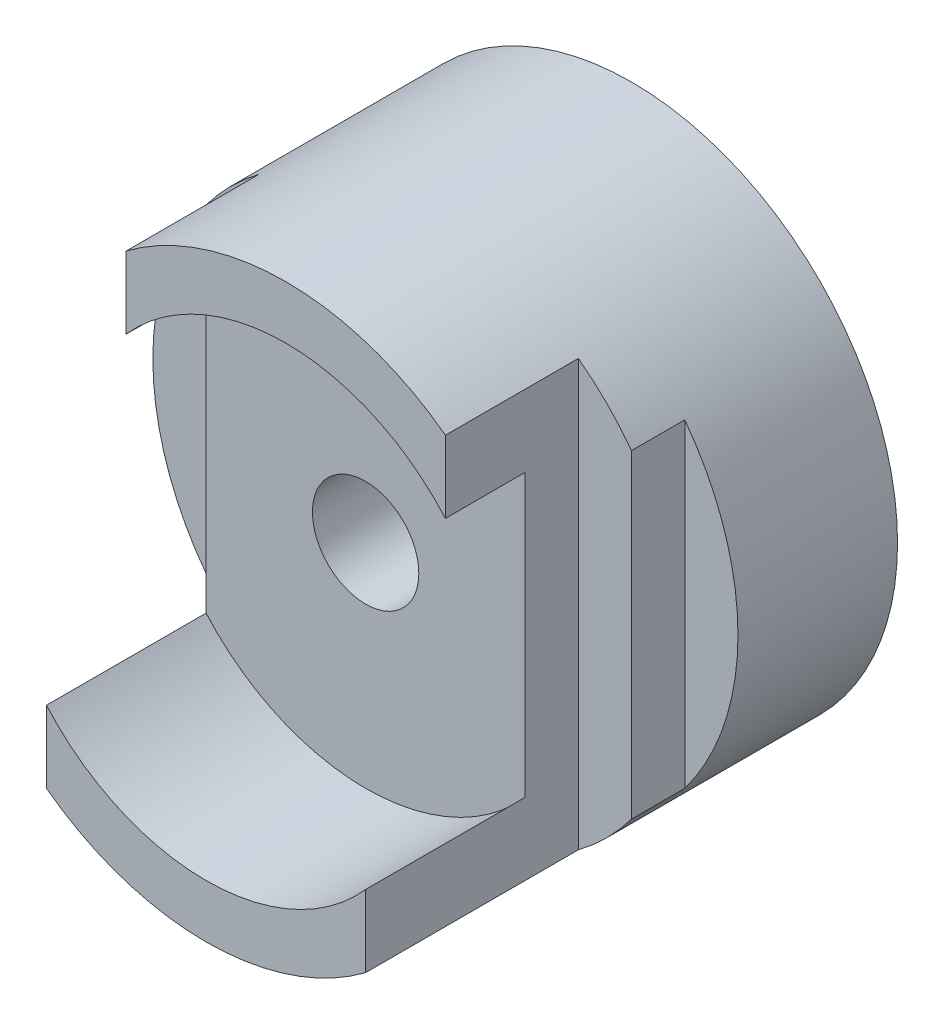
ISO-10303-21;
HEADER;
FILE_DESCRIPTION(('STEP AP214'),'2;1');
FILE_NAME('part.step','',(''),(''),'','','');
FILE_SCHEMA(('AUTOMOTIVE_DESIGN { 1 0 10303 214 1 1 1 1 }'));
ENDSEC;
DATA;
#1=APPLICATION_CONTEXT('core data for automotive mechanical design processes');
#2=APPLICATION_PROTOCOL_DEFINITION('international standard','automotive_design',2000,#1);
#3=PRODUCT_CONTEXT('',#1,'mechanical');
#4=PRODUCT('Part','Part','',(#3));
#5=PRODUCT_RELATED_PRODUCT_CATEGORY('part','',(#4));
#6=PRODUCT_DEFINITION_FORMATION('','',#4);
#7=PRODUCT_DEFINITION_CONTEXT('part definition',#1,'design');
#8=PRODUCT_DEFINITION('design','',#6,#7);
#9=PRODUCT_DEFINITION_SHAPE('','',#8);
#10=(LENGTH_UNIT() NAMED_UNIT(*) SI_UNIT(.MILLI.,.METRE.));
#11=(NAMED_UNIT(*) PLANE_ANGLE_UNIT() SI_UNIT($,.RADIAN.));
#12=(NAMED_UNIT(*) SI_UNIT($,.STERADIAN.) SOLID_ANGLE_UNIT());
#13=UNCERTAINTY_MEASURE_WITH_UNIT(LENGTH_MEASURE(1.E-05),#10,'distance_accuracy_value','');
#14=(GEOMETRIC_REPRESENTATION_CONTEXT(3) GLOBAL_UNCERTAINTY_ASSIGNED_CONTEXT((#13)) GLOBAL_UNIT_ASSIGNED_CONTEXT((#10,
#11,#12)) REPRESENTATION_CONTEXT('',''));
#15=CARTESIAN_POINT('',(0.,0.,0.));
#16=DIRECTION('',(0.,0.,1.));
#17=DIRECTION('',(1.,0.,0.));
#18=AXIS2_PLACEMENT_3D('',#15,#16,#17);
#19=CARTESIAN_POINT('',(0.,0.,8.));
#20=DIRECTION('',(0.,0.,-1.));
#21=DIRECTION('',(-1.,0.,0.));
#22=AXIS2_PLACEMENT_3D('',#19,#20,#21);
#23=CYLINDRICAL_SURFACE('',#22,1.);
#24=CARTESIAN_POINT('',(0.,0.,0.));
#25=DIRECTION('',(0.,0.,1.));
#26=DIRECTION('',(1.,0.,0.));
#27=AXIS2_PLACEMENT_3D('',#24,#25,#26);
#28=CIRCLE('',#27,1.);
#29=CARTESIAN_POINT('',(1.,0.,0.));
#30=VERTEX_POINT('',#29);
#31=EDGE_CURVE('E171',#30,#30,#28,.T.);
#32=ORIENTED_EDGE('',*,*,#31,.F.);
#33=EDGE_LOOP('',(#32));
#34=FACE_BOUND('',#33,.T.);
#35=CARTESIAN_POINT('',(0.,0.,5.));
#36=DIRECTION('',(0.,0.,1.));
#37=DIRECTION('',(1.,0.,0.));
#38=AXIS2_PLACEMENT_3D('',#35,#36,#37);
#39=CIRCLE('',#38,1.);
#40=CARTESIAN_POINT('',(1.,0.,5.));
#41=VERTEX_POINT('',#40);
#42=EDGE_CURVE('E213',#41,#41,#39,.T.);
#43=ORIENTED_EDGE('',*,*,#42,.T.);
#44=EDGE_LOOP('',(#43));
#45=FACE_BOUND('',#44,.T.);
#46=ADVANCED_FACE('F33',(#34,#45),#23,.F.);
#47=CARTESIAN_POINT('',(0.,0.,8.));
#48=DIRECTION('',(0.,0.,-1.));
#49=DIRECTION('',(-1.,0.,0.));
#50=AXIS2_PLACEMENT_3D('',#47,#48,#49);
#51=CYLINDRICAL_SURFACE('',#50,5.);
#52=CARTESIAN_POINT('',(0.,0.,0.999999999999999));
#53=DIRECTION('',(0.,0.,1.));
#54=DIRECTION('',(1.,0.,0.));
#55=AXIS2_PLACEMENT_3D('',#52,#53,#54);
#56=CIRCLE('',#55,5.);
#57=CARTESIAN_POINT('',(-4.,3.,1.));
#58=VERTEX_POINT('',#57);
#59=CARTESIAN_POINT('',(-4.,-3.,1.));
#60=VERTEX_POINT('',#59);
#61=EDGE_CURVE('E149',#58,#60,#56,.T.);
#62=ORIENTED_EDGE('',*,*,#61,.T.);
#63=DIRECTION('',(0.,0.,-1.));
#64=VECTOR('',#63,1.);
#65=CARTESIAN_POINT('',(-3.99999999999999,-3.00000000000001,8.));
#66=LINE('',#65,#64);
#67=CARTESIAN_POINT('',(-4.,-3.00000000000001,0.));
#68=VERTEX_POINT('',#67);
#69=EDGE_CURVE('E141',#60,#68,#66,.T.);
#70=ORIENTED_EDGE('',*,*,#69,.T.);
#71=CARTESIAN_POINT('',(0.,0.,0.));
#72=DIRECTION('',(0.,0.,1.));
#73=DIRECTION('',(1.,0.,0.));
#74=AXIS2_PLACEMENT_3D('',#71,#72,#73);
#75=CIRCLE('',#74,5.);
#76=CARTESIAN_POINT('',(-4.,3.00000000000001,0.));
#77=VERTEX_POINT('',#76);
#78=EDGE_CURVE('E168',#68,#77,#75,.T.);
#79=ORIENTED_EDGE('',*,*,#78,.T.);
#80=DIRECTION('',(0.,0.,-1.));
#81=VECTOR('',#80,1.);
#82=CARTESIAN_POINT('',(-3.99999999999999,3.00000000000001,8.));
#83=LINE('',#82,#81);
#84=EDGE_CURVE('E146',#77,#58,#83,.F.);
#85=ORIENTED_EDGE('',*,*,#84,.T.);
#86=EDGE_LOOP('',(#62,#70,#79,#85));
#87=FACE_BOUND('',#86,.T.);
#88=DIRECTION('',(0.,0.,-1.));
#89=VECTOR('',#88,1.);
#90=CARTESIAN_POINT('',(-3.,4.,8.));
#91=LINE('',#90,#89);
#92=CARTESIAN_POINT('',(-3.,4.,6.5));
#93=VERTEX_POINT('',#92);
#94=CARTESIAN_POINT('',(-3.,4.,4.));
#95=VERTEX_POINT('',#94);
#96=EDGE_CURVE('E184',#93,#95,#91,.T.);
#97=ORIENTED_EDGE('',*,*,#96,.F.);
#98=CARTESIAN_POINT('',(0.,0.,6.5));
#99=DIRECTION('',(0.,0.,-1.));
#100=DIRECTION('',(-1.,0.,0.));
#101=AXIS2_PLACEMENT_3D('',#98,#99,#100);
#102=CIRCLE('',#101,5.);
#103=CARTESIAN_POINT('',(3.,4.,6.5));
#104=VERTEX_POINT('',#103);
#105=EDGE_CURVE('E220',#93,#104,#102,.T.);
#106=ORIENTED_EDGE('',*,*,#105,.T.);
#107=DIRECTION('',(0.,0.,1.));
#108=VECTOR('',#107,1.);
#109=CARTESIAN_POINT('',(3.,4.,8.));
#110=LINE('',#109,#108);
#111=CARTESIAN_POINT('',(3.,4.,4.));
#112=VERTEX_POINT('',#111);
#113=EDGE_CURVE('E132',#112,#104,#110,.T.);
#114=ORIENTED_EDGE('',*,*,#113,.F.);
#115=CARTESIAN_POINT('',(0.,0.,4.));
#116=DIRECTION('',(0.,0.,-1.));
#117=DIRECTION('',(-1.,0.,0.));
#118=AXIS2_PLACEMENT_3D('',#115,#116,#117);
#119=CIRCLE('',#118,5.);
#120=CARTESIAN_POINT('',(4.,3.,4.));
#121=VERTEX_POINT('',#120);
#122=EDGE_CURVE('E161',#112,#121,#119,.T.);
#123=ORIENTED_EDGE('',*,*,#122,.T.);
#124=DIRECTION('',(0.,0.,-1.));
#125=VECTOR('',#124,1.);
#126=CARTESIAN_POINT('',(4.,3.,8.));
#127=LINE('',#126,#125);
#128=CARTESIAN_POINT('',(4.,3.,3.));
#129=VERTEX_POINT('',#128);
#130=EDGE_CURVE('E158',#121,#129,#127,.T.);
#131=ORIENTED_EDGE('',*,*,#130,.T.);
#132=CARTESIAN_POINT('',(0.,0.,3.));
#133=DIRECTION('',(0.,0.,-1.));
#134=DIRECTION('',(-1.,0.,0.));
#135=AXIS2_PLACEMENT_3D('',#132,#133,#134);
#136=CIRCLE('',#135,5.);
#137=CARTESIAN_POINT('',(4.,-3.,3.));
#138=VERTEX_POINT('',#137);
#139=EDGE_CURVE('E156',#129,#138,#136,.T.);
#140=ORIENTED_EDGE('',*,*,#139,.T.);
#141=DIRECTION('',(0.,0.,-1.));
#142=VECTOR('',#141,1.);
#143=CARTESIAN_POINT('',(4.,-3.,8.));
#144=LINE('',#143,#142);
#145=CARTESIAN_POINT('',(4.,-3.,4.));
#146=VERTEX_POINT('',#145);
#147=EDGE_CURVE('E152',#138,#146,#144,.F.);
#148=ORIENTED_EDGE('',*,*,#147,.T.);
#149=CARTESIAN_POINT('',(3.,-4.,4.));
#150=VERTEX_POINT('',#149);
#151=EDGE_CURVE('E155',#146,#150,#119,.T.);
#152=ORIENTED_EDGE('',*,*,#151,.T.);
#153=DIRECTION('',(0.,0.,1.));
#154=VECTOR('',#153,1.);
#155=CARTESIAN_POINT('',(3.,-4.,8.));
#156=LINE('',#155,#154);
#157=CARTESIAN_POINT('',(3.,-4.,8.));
#158=VERTEX_POINT('',#157);
#159=EDGE_CURVE('E192',#150,#158,#156,.T.);
#160=ORIENTED_EDGE('',*,*,#159,.T.);
#161=CARTESIAN_POINT('',(0.,0.,8.));
#162=DIRECTION('',(0.,0.,1.));
#163=DIRECTION('',(1.,0.,0.));
#164=AXIS2_PLACEMENT_3D('',#161,#162,#163);
#165=CIRCLE('',#164,5.);
#166=CARTESIAN_POINT('',(-3.,-4.,8.));
#167=VERTEX_POINT('',#166);
#168=EDGE_CURVE('E167',#167,#158,#165,.T.);
#169=ORIENTED_EDGE('',*,*,#168,.F.);
#170=DIRECTION('',(0.,0.,-1.));
#171=VECTOR('',#170,1.);
#172=CARTESIAN_POINT('',(-3.,-4.,8.));
#173=LINE('',#172,#171);
#174=CARTESIAN_POINT('',(-3.,-4.,4.));
#175=VERTEX_POINT('',#174);
#176=EDGE_CURVE('E181',#167,#175,#173,.T.);
#177=ORIENTED_EDGE('',*,*,#176,.T.);
#178=CARTESIAN_POINT('',(0.,0.,4.));
#179=DIRECTION('',(0.,0.,-1.));
#180=DIRECTION('',(-1.,0.,0.));
#181=AXIS2_PLACEMENT_3D('',#178,#179,#180);
#182=CIRCLE('',#181,5.);
#183=EDGE_CURVE('E164',#175,#95,#182,.T.);
#184=ORIENTED_EDGE('',*,*,#183,.T.);
#185=EDGE_LOOP('',(#97,#106,#114,#123,#131,#140,#148,#152,#160,#169,#177,#184));
#186=FACE_BOUND('',#185,.T.);
#187=ADVANCED_FACE('F35',(#87,#186),#51,.T.);
#188=CARTESIAN_POINT('',(0.,0.,8.));
#189=DIRECTION('',(0.,0.,1.));
#190=DIRECTION('',(1.,0.,0.));
#191=AXIS2_PLACEMENT_3D('',#188,#189,#190);
#192=PLANE('',#191);
#193=CARTESIAN_POINT('',(0.,0.,8.));
#194=DIRECTION('',(0.,0.,1.));
#195=DIRECTION('',(1.,0.,0.));
#196=AXIS2_PLACEMENT_3D('',#193,#194,#195);
#197=CIRCLE('',#196,4.);
#198=CARTESIAN_POINT('',(-3.,-2.64575131106459,8.));
#199=VERTEX_POINT('',#198);
#200=CARTESIAN_POINT('',(3.,-2.64575131106459,8.));
#201=VERTEX_POINT('',#200);
#202=EDGE_CURVE('E218',#199,#201,#197,.T.);
#203=ORIENTED_EDGE('',*,*,#202,.F.);
#204=DIRECTION('',(0.,1.,0.));
#205=VECTOR('',#204,1.);
#206=CARTESIAN_POINT('',(-3.,-4.,8.));
#207=LINE('',#206,#205);
#208=EDGE_CURVE('E177',#167,#199,#207,.T.);
#209=ORIENTED_EDGE('',*,*,#208,.F.);
#210=ORIENTED_EDGE('',*,*,#168,.T.);
#211=DIRECTION('',(0.,1.,0.));
#212=VECTOR('',#211,1.);
#213=CARTESIAN_POINT('',(3.,-4.,8.));
#214=LINE('',#213,#212);
#215=EDGE_CURVE('E191',#158,#201,#214,.T.);
#216=ORIENTED_EDGE('',*,*,#215,.T.);
#217=EDGE_LOOP('',(#203,#209,#210,#216));
#218=FACE_BOUND('',#217,.T.);
#219=ADVANCED_FACE('F235',(#218),#192,.T.);
#220=CARTESIAN_POINT('',(0.,0.,0.));
#221=DIRECTION('',(0.,0.,1.));
#222=DIRECTION('',(1.,0.,0.));
#223=AXIS2_PLACEMENT_3D('',#220,#221,#222);
#224=PLANE('',#223);
#225=ORIENTED_EDGE('',*,*,#78,.F.);
#226=DIRECTION('',(0.,1.,0.));
#227=VECTOR('',#226,1.);
#228=CARTESIAN_POINT('',(-4.,-4.,0.));
#229=LINE('',#228,#227);
#230=EDGE_CURVE('E176',#68,#77,#229,.T.);
#231=ORIENTED_EDGE('',*,*,#230,.T.);
#232=EDGE_LOOP('',(#225,#231));
#233=FACE_BOUND('',#232,.T.);
#234=ORIENTED_EDGE('',*,*,#31,.T.);
#235=EDGE_LOOP('',(#234));
#236=FACE_BOUND('',#235,.T.);
#237=ADVANCED_FACE('F265',(#233,#236),#224,.F.);
#238=CARTESIAN_POINT('',(-5.,-4.,4.));
#239=DIRECTION('',(0.,0.,-1.));
#240=DIRECTION('',(-1.,0.,0.));
#241=AXIS2_PLACEMENT_3D('',#238,#239,#240);
#242=PLANE('',#241);
#243=ORIENTED_EDGE('',*,*,#183,.F.);
#244=DIRECTION('',(0.,1.,0.));
#245=VECTOR('',#244,1.);
#246=CARTESIAN_POINT('',(-3.,-4.,4.));
#247=LINE('',#246,#245);
#248=EDGE_CURVE('E180',#175,#95,#247,.T.);
#249=ORIENTED_EDGE('',*,*,#248,.T.);
#250=EDGE_LOOP('',(#243,#249));
#251=FACE_BOUND('',#250,.T.);
#252=ADVANCED_FACE('F231',(#251),#242,.F.);
#253=CARTESIAN_POINT('',(-3.,-4.,8.));
#254=DIRECTION('',(1.,0.,0.));
#255=DIRECTION('',(0.,0.,-1.));
#256=AXIS2_PLACEMENT_3D('',#253,#254,#255);
#257=PLANE('',#256);
#258=DIRECTION('',(0.,0.,1.));
#259=VECTOR('',#258,1.);
#260=CARTESIAN_POINT('',(-3.,2.64575131106459,5.));
#261=LINE('',#260,#259);
#262=CARTESIAN_POINT('',(-3.,2.64575131106459,5.));
#263=VERTEX_POINT('',#262);
#264=CARTESIAN_POINT('',(-3.,2.64575131106459,6.5));
#265=VERTEX_POINT('',#264);
#266=EDGE_CURVE('E186',#263,#265,#261,.T.);
#267=ORIENTED_EDGE('',*,*,#266,.T.);
#268=DIRECTION('',(0.,1.,0.));
#269=VECTOR('',#268,1.);
#270=CARTESIAN_POINT('',(-3.,-4.,6.5));
#271=LINE('',#270,#269);
#272=EDGE_CURVE('E48',#265,#93,#271,.T.);
#273=ORIENTED_EDGE('',*,*,#272,.T.);
#274=ORIENTED_EDGE('',*,*,#96,.T.);
#275=ORIENTED_EDGE('',*,*,#248,.F.);
#276=ORIENTED_EDGE('',*,*,#176,.F.);
#277=ORIENTED_EDGE('',*,*,#208,.T.);
#278=DIRECTION('',(0.,0.,1.));
#279=VECTOR('',#278,1.);
#280=CARTESIAN_POINT('',(-3.,-2.64575131106459,5.));
#281=LINE('',#280,#279);
#282=CARTESIAN_POINT('',(-3.,-2.64575131106459,5.));
#283=VERTEX_POINT('',#282);
#284=EDGE_CURVE('E210',#199,#283,#281,.F.);
#285=ORIENTED_EDGE('',*,*,#284,.T.);
#286=DIRECTION('',(0.,-1.,0.));
#287=VECTOR('',#286,1.);
#288=CARTESIAN_POINT('',(-3.,-4.,5.));
#289=LINE('',#288,#287);
#290=EDGE_CURVE('E216',#263,#283,#289,.T.);
#291=ORIENTED_EDGE('',*,*,#290,.F.);
#292=EDGE_LOOP('',(#267,#273,#274,#275,#276,#277,#285,#291));
#293=FACE_BOUND('',#292,.T.);
#294=ADVANCED_FACE('F225',(#293),#257,.F.);
#295=CARTESIAN_POINT('',(3.,-4.,4.));
#296=DIRECTION('',(0.,0.,-1.));
#297=DIRECTION('',(-1.,0.,0.));
#298=AXIS2_PLACEMENT_3D('',#295,#296,#297);
#299=PLANE('',#298);
#300=DIRECTION('',(0.,1.,0.));
#301=VECTOR('',#300,1.);
#302=CARTESIAN_POINT('',(3.,-4.,4.));
#303=LINE('',#302,#301);
#304=EDGE_CURVE('E189',#150,#112,#303,.T.);
#305=ORIENTED_EDGE('',*,*,#304,.F.);
#306=ORIENTED_EDGE('',*,*,#151,.F.);
#307=DIRECTION('',(0.,1.,0.));
#308=VECTOR('',#307,1.);
#309=CARTESIAN_POINT('',(4.,-4.,4.));
#310=LINE('',#309,#308);
#311=EDGE_CURVE('E198',#146,#121,#310,.T.);
#312=ORIENTED_EDGE('',*,*,#311,.T.);
#313=ORIENTED_EDGE('',*,*,#122,.F.);
#314=EDGE_LOOP('',(#305,#306,#312,#313));
#315=FACE_BOUND('',#314,.T.);
#316=ADVANCED_FACE('F290',(#315),#299,.F.);
#317=CARTESIAN_POINT('',(4.,-4.,4.));
#318=DIRECTION('',(-1.,0.,0.));
#319=DIRECTION('',(0.,0.,1.));
#320=AXIS2_PLACEMENT_3D('',#317,#318,#319);
#321=PLANE('',#320);
#322=ORIENTED_EDGE('',*,*,#311,.F.);
#323=ORIENTED_EDGE('',*,*,#147,.F.);
#324=DIRECTION('',(0.,1.,0.));
#325=VECTOR('',#324,1.);
#326=CARTESIAN_POINT('',(4.,-4.,3.));
#327=LINE('',#326,#325);
#328=EDGE_CURVE('E195',#138,#129,#327,.T.);
#329=ORIENTED_EDGE('',*,*,#328,.T.);
#330=ORIENTED_EDGE('',*,*,#130,.F.);
#331=EDGE_LOOP('',(#322,#323,#329,#330));
#332=FACE_BOUND('',#331,.T.);
#333=ADVANCED_FACE('F286',(#332),#321,.F.);
#334=CARTESIAN_POINT('',(4.,-4.,3.));
#335=DIRECTION('',(0.,0.,-1.));
#336=DIRECTION('',(-1.,0.,0.));
#337=AXIS2_PLACEMENT_3D('',#334,#335,#336);
#338=PLANE('',#337);
#339=ORIENTED_EDGE('',*,*,#328,.F.);
#340=ORIENTED_EDGE('',*,*,#139,.F.);
#341=EDGE_LOOP('',(#339,#340));
#342=FACE_BOUND('',#341,.T.);
#343=ADVANCED_FACE('F289',(#342),#338,.F.);
#344=CARTESIAN_POINT('',(3.,-4.,8.));
#345=DIRECTION('',(-1.,0.,0.));
#346=DIRECTION('',(0.,0.,1.));
#347=AXIS2_PLACEMENT_3D('',#344,#345,#346);
#348=PLANE('',#347);
#349=ORIENTED_EDGE('',*,*,#113,.T.);
#350=DIRECTION('',(0.,-1.,0.));
#351=VECTOR('',#350,1.);
#352=CARTESIAN_POINT('',(3.,-4.,6.5));
#353=LINE('',#352,#351);
#354=CARTESIAN_POINT('',(3.,2.64575131106459,6.5));
#355=VERTEX_POINT('',#354);
#356=EDGE_CURVE('E121',#104,#355,#353,.T.);
#357=ORIENTED_EDGE('',*,*,#356,.T.);
#358=DIRECTION('',(0.,0.,1.));
#359=VECTOR('',#358,1.);
#360=CARTESIAN_POINT('',(3.,2.64575131106459,5.));
#361=LINE('',#360,#359);
#362=CARTESIAN_POINT('',(3.,2.64575131106459,5.));
#363=VERTEX_POINT('',#362);
#364=EDGE_CURVE('E130',#355,#363,#361,.F.);
#365=ORIENTED_EDGE('',*,*,#364,.T.);
#366=DIRECTION('',(0.,1.,0.));
#367=VECTOR('',#366,1.);
#368=CARTESIAN_POINT('',(3.,-4.,5.));
#369=LINE('',#368,#367);
#370=CARTESIAN_POINT('',(3.,-2.64575131106459,5.));
#371=VERTEX_POINT('',#370);
#372=EDGE_CURVE('E138',#371,#363,#369,.T.);
#373=ORIENTED_EDGE('',*,*,#372,.F.);
#374=DIRECTION('',(0.,0.,1.));
#375=VECTOR('',#374,1.);
#376=CARTESIAN_POINT('',(3.,-2.64575131106459,5.));
#377=LINE('',#376,#375);
#378=EDGE_CURVE('E41',#371,#201,#377,.T.);
#379=ORIENTED_EDGE('',*,*,#378,.T.);
#380=ORIENTED_EDGE('',*,*,#215,.F.);
#381=ORIENTED_EDGE('',*,*,#159,.F.);
#382=ORIENTED_EDGE('',*,*,#304,.T.);
#383=EDGE_LOOP('',(#349,#357,#365,#373,#379,#380,#381,#382));
#384=FACE_BOUND('',#383,.T.);
#385=ADVANCED_FACE('F128',(#384),#348,.F.);
#386=CARTESIAN_POINT('',(-4.,-4.,0.));
#387=DIRECTION('',(1.,0.,0.));
#388=DIRECTION('',(0.,0.,-1.));
#389=AXIS2_PLACEMENT_3D('',#386,#387,#388);
#390=PLANE('',#389);
#391=DIRECTION('',(0.,1.,0.));
#392=VECTOR('',#391,1.);
#393=CARTESIAN_POINT('',(-4.,-4.,1.));
#394=LINE('',#393,#392);
#395=EDGE_CURVE('E201',#60,#58,#394,.T.);
#396=ORIENTED_EDGE('',*,*,#395,.T.);
#397=ORIENTED_EDGE('',*,*,#84,.F.);
#398=ORIENTED_EDGE('',*,*,#230,.F.);
#399=ORIENTED_EDGE('',*,*,#69,.F.);
#400=EDGE_LOOP('',(#396,#397,#398,#399));
#401=FACE_BOUND('',#400,.T.);
#402=ADVANCED_FACE('F275',(#401),#390,.F.);
#403=CARTESIAN_POINT('',(-5.,-4.,1.));
#404=DIRECTION('',(0.,0.,1.));
#405=DIRECTION('',(1.,0.,0.));
#406=AXIS2_PLACEMENT_3D('',#403,#404,#405);
#407=PLANE('',#406);
#408=ORIENTED_EDGE('',*,*,#395,.F.);
#409=ORIENTED_EDGE('',*,*,#61,.F.);
#410=EDGE_LOOP('',(#408,#409));
#411=FACE_BOUND('',#410,.T.);
#412=ADVANCED_FACE('F277',(#411),#407,.F.);
#413=CARTESIAN_POINT('',(0.,0.,5.));
#414=DIRECTION('',(0.,0.,1.));
#415=DIRECTION('',(1.,0.,0.));
#416=AXIS2_PLACEMENT_3D('',#413,#414,#415);
#417=CYLINDRICAL_SURFACE('',#416,4.);
#418=ORIENTED_EDGE('',*,*,#364,.F.);
#419=CARTESIAN_POINT('',(0.,0.,6.5));
#420=DIRECTION('',(0.,0.,-1.));
#421=DIRECTION('',(-1.,0.,0.));
#422=AXIS2_PLACEMENT_3D('',#419,#420,#421);
#423=CIRCLE('',#422,4.);
#424=EDGE_CURVE('E11',#355,#265,#423,.F.);
#425=ORIENTED_EDGE('',*,*,#424,.T.);
#426=ORIENTED_EDGE('',*,*,#266,.F.);
#427=CARTESIAN_POINT('',(0.,0.,5.));
#428=DIRECTION('',(0.,0.,1.));
#429=DIRECTION('',(1.,0.,0.));
#430=AXIS2_PLACEMENT_3D('',#427,#428,#429);
#431=CIRCLE('',#430,4.);
#432=EDGE_CURVE('E137',#363,#263,#431,.T.);
#433=ORIENTED_EDGE('',*,*,#432,.F.);
#434=EDGE_LOOP('',(#418,#425,#426,#433));
#435=FACE_BOUND('',#434,.T.);
#436=ADVANCED_FACE('F135',(#435),#417,.F.);
#437=ORIENTED_EDGE('',*,*,#202,.T.);
#438=ORIENTED_EDGE('',*,*,#378,.F.);
#439=EDGE_CURVE('E55',#283,#371,#431,.T.);
#440=ORIENTED_EDGE('',*,*,#439,.F.);
#441=ORIENTED_EDGE('',*,*,#284,.F.);
#442=EDGE_LOOP('',(#437,#438,#440,#441));
#443=FACE_BOUND('',#442,.T.);
#444=ADVANCED_FACE('F240',(#443),#417,.F.);
#445=CARTESIAN_POINT('',(0.,0.,5.));
#446=DIRECTION('',(0.,0.,1.));
#447=DIRECTION('',(1.,0.,0.));
#448=AXIS2_PLACEMENT_3D('',#445,#446,#447);
#449=PLANE('',#448);
#450=ORIENTED_EDGE('',*,*,#42,.F.);
#451=EDGE_LOOP('',(#450));
#452=FACE_BOUND('',#451,.T.);
#453=ORIENTED_EDGE('',*,*,#290,.T.);
#454=ORIENTED_EDGE('',*,*,#439,.T.);
#455=ORIENTED_EDGE('',*,*,#372,.T.);
#456=ORIENTED_EDGE('',*,*,#432,.T.);
#457=EDGE_LOOP('',(#453,#454,#455,#456));
#458=FACE_BOUND('',#457,.T.);
#459=ADVANCED_FACE('F241',(#452,#458),#449,.T.);
#460=CARTESIAN_POINT('',(0.,0.,6.5));
#461=DIRECTION('',(0.,0.,-1.));
#462=DIRECTION('',(-1.,0.,0.));
#463=AXIS2_PLACEMENT_3D('',#460,#461,#462);
#464=PLANE('',#463);
#465=ORIENTED_EDGE('',*,*,#272,.F.);
#466=ORIENTED_EDGE('',*,*,#424,.F.);
#467=ORIENTED_EDGE('',*,*,#356,.F.);
#468=ORIENTED_EDGE('',*,*,#105,.F.);
#469=EDGE_LOOP('',(#465,#466,#467,#468));
#470=FACE_BOUND('',#469,.T.);
#471=ADVANCED_FACE('F120',(#470),#464,.F.);
#472=CLOSED_SHELL('',(#46,#187,#219,#237,#252,#294,#316,#333,#343,#385,#402,#412,#436,#444,#459,#471));
#473=MANIFOLD_SOLID_BREP('B2',#472);
#474=ADVANCED_BREP_SHAPE_REPRESENTATION('',(#18,#473),#14);
#475=SHAPE_DEFINITION_REPRESENTATION(#9,#474);
ENDSEC;
END-ISO-10303-21;
